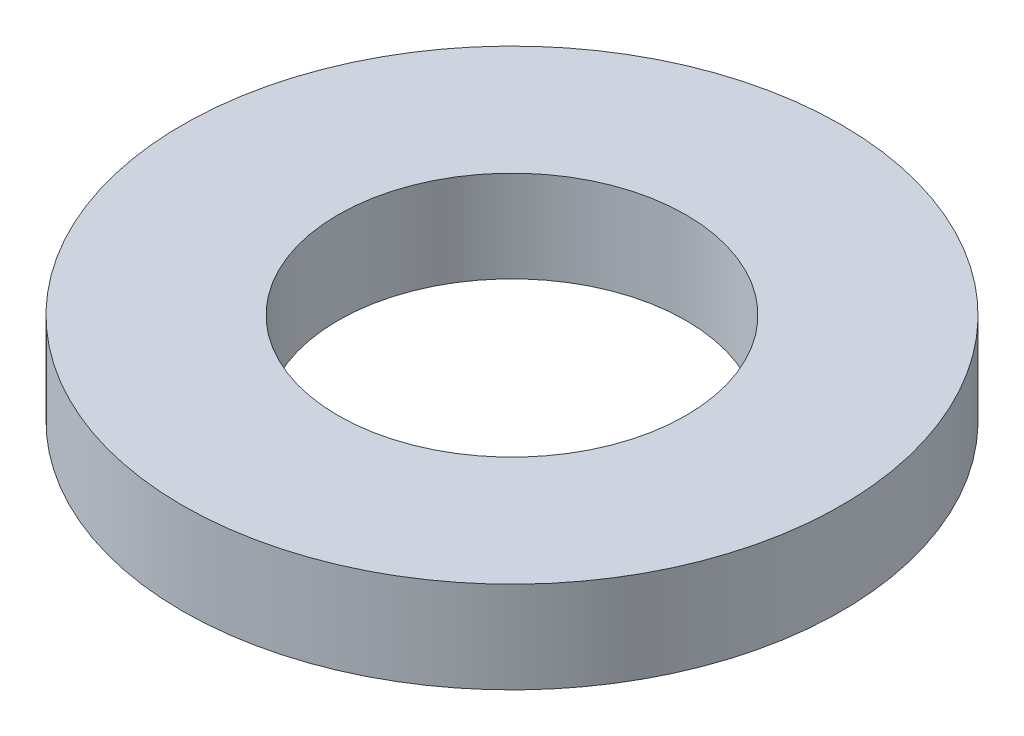
ISO-10303-21;
HEADER;
FILE_DESCRIPTION(('STEP AP214'),'2;1');
FILE_NAME('part.step','',(''),(''),'','','');
FILE_SCHEMA(('AUTOMOTIVE_DESIGN { 1 0 10303 214 1 1 1 1 }'));
ENDSEC;
DATA;
#1=APPLICATION_CONTEXT('core data for automotive mechanical design processes');
#2=APPLICATION_PROTOCOL_DEFINITION('international standard','automotive_design',2000,#1);
#3=PRODUCT_CONTEXT('',#1,'mechanical');
#4=PRODUCT('Part','Part','',(#3));
#5=PRODUCT_RELATED_PRODUCT_CATEGORY('part','',(#4));
#6=PRODUCT_DEFINITION_FORMATION('','',#4);
#7=PRODUCT_DEFINITION_CONTEXT('part definition',#1,'design');
#8=PRODUCT_DEFINITION('design','',#6,#7);
#9=PRODUCT_DEFINITION_SHAPE('','',#8);
#10=(LENGTH_UNIT() NAMED_UNIT(*) SI_UNIT(.MILLI.,.METRE.));
#11=(NAMED_UNIT(*) PLANE_ANGLE_UNIT() SI_UNIT($,.RADIAN.));
#12=(NAMED_UNIT(*) SI_UNIT($,.STERADIAN.) SOLID_ANGLE_UNIT());
#13=UNCERTAINTY_MEASURE_WITH_UNIT(LENGTH_MEASURE(1.E-05),#10,'distance_accuracy_value','');
#14=(GEOMETRIC_REPRESENTATION_CONTEXT(3) GLOBAL_UNCERTAINTY_ASSIGNED_CONTEXT((#13)) GLOBAL_UNIT_ASSIGNED_CONTEXT((#10,
#11,#12)) REPRESENTATION_CONTEXT('',''));
#15=CARTESIAN_POINT('',(0.,0.,0.));
#16=DIRECTION('',(0.,0.,1.));
#17=DIRECTION('',(1.,0.,0.));
#18=AXIS2_PLACEMENT_3D('',#15,#16,#17);
#19=CARTESIAN_POINT('',(0.,25.,0.));
#20=DIRECTION('',(0.,-1.,0.));
#21=DIRECTION('',(0.,0.,-1.));
#22=AXIS2_PLACEMENT_3D('',#19,#20,#21);
#23=CYLINDRICAL_SURFACE('',#22,90.);
#24=CARTESIAN_POINT('',(0.,25.,0.));
#25=DIRECTION('',(0.,1.,0.));
#26=DIRECTION('',(0.,0.,1.));
#27=AXIS2_PLACEMENT_3D('',#24,#25,#26);
#28=CIRCLE('',#27,90.);
#29=CARTESIAN_POINT('',(0.,25.,90.));
#30=VERTEX_POINT('',#29);
#31=EDGE_CURVE('E10',#30,#30,#28,.T.);
#32=ORIENTED_EDGE('',*,*,#31,.F.);
#33=EDGE_LOOP('',(#32));
#34=FACE_BOUND('',#33,.T.);
#35=CARTESIAN_POINT('',(0.,0.,0.));
#36=DIRECTION('',(0.,1.,0.));
#37=DIRECTION('',(0.,0.,1.));
#38=AXIS2_PLACEMENT_3D('',#35,#36,#37);
#39=CIRCLE('',#38,90.);
#40=CARTESIAN_POINT('',(0.,0.,90.));
#41=VERTEX_POINT('',#40);
#42=EDGE_CURVE('E37',#41,#41,#39,.T.);
#43=ORIENTED_EDGE('',*,*,#42,.T.);
#44=EDGE_LOOP('',(#43));
#45=FACE_BOUND('',#44,.T.);
#46=ADVANCED_FACE('F40',(#34,#45),#23,.T.);
#47=CARTESIAN_POINT('',(0.,25.,0.));
#48=DIRECTION('',(0.,1.,0.));
#49=DIRECTION('',(0.,0.,1.));
#50=AXIS2_PLACEMENT_3D('',#47,#48,#49);
#51=PLANE('',#50);
#52=CARTESIAN_POINT('',(0.,25.,0.));
#53=DIRECTION('',(0.,1.,0.));
#54=DIRECTION('',(0.,0.,1.));
#55=AXIS2_PLACEMENT_3D('',#52,#53,#54);
#56=CIRCLE('',#55,47.5);
#57=CARTESIAN_POINT('',(0.,25.,47.5));
#58=VERTEX_POINT('',#57);
#59=EDGE_CURVE('E50',#58,#58,#56,.T.);
#60=ORIENTED_EDGE('',*,*,#59,.F.);
#61=EDGE_LOOP('',(#60));
#62=FACE_BOUND('',#61,.T.);
#63=ORIENTED_EDGE('',*,*,#31,.T.);
#64=EDGE_LOOP('',(#63));
#65=FACE_BOUND('',#64,.T.);
#66=ADVANCED_FACE('F59',(#62,#65),#51,.T.);
#67=CARTESIAN_POINT('',(0.,0.,0.));
#68=DIRECTION('',(0.,1.,0.));
#69=DIRECTION('',(0.,0.,1.));
#70=AXIS2_PLACEMENT_3D('',#67,#68,#69);
#71=PLANE('',#70);
#72=CARTESIAN_POINT('',(0.,0.,0.));
#73=DIRECTION('',(0.,1.,0.));
#74=DIRECTION('',(0.,0.,1.));
#75=AXIS2_PLACEMENT_3D('',#72,#73,#74);
#76=CIRCLE('',#75,47.5);
#77=CARTESIAN_POINT('',(0.,0.,47.5));
#78=VERTEX_POINT('',#77);
#79=EDGE_CURVE('E47',#78,#78,#76,.T.);
#80=ORIENTED_EDGE('',*,*,#79,.T.);
#81=EDGE_LOOP('',(#80));
#82=FACE_BOUND('',#81,.T.);
#83=ORIENTED_EDGE('',*,*,#42,.F.);
#84=EDGE_LOOP('',(#83));
#85=FACE_BOUND('',#84,.T.);
#86=ADVANCED_FACE('F58',(#82,#85),#71,.F.);
#87=CARTESIAN_POINT('',(0.,25.,0.));
#88=DIRECTION('',(0.,-1.,0.));
#89=DIRECTION('',(0.,0.,-1.));
#90=AXIS2_PLACEMENT_3D('',#87,#88,#89);
#91=CYLINDRICAL_SURFACE('',#90,47.5);
#92=ORIENTED_EDGE('',*,*,#59,.T.);
#93=EDGE_LOOP('',(#92));
#94=FACE_BOUND('',#93,.T.);
#95=ORIENTED_EDGE('',*,*,#79,.F.);
#96=EDGE_LOOP('',(#95));
#97=FACE_BOUND('',#96,.T.);
#98=ADVANCED_FACE('F54',(#94,#97),#91,.F.);
#99=CLOSED_SHELL('',(#46,#66,#86,#98));
#100=MANIFOLD_SOLID_BREP('B2',#99);
#101=ADVANCED_BREP_SHAPE_REPRESENTATION('',(#18,#100),#14);
#102=SHAPE_DEFINITION_REPRESENTATION(#9,#101);
ENDSEC;
END-ISO-10303-21;
